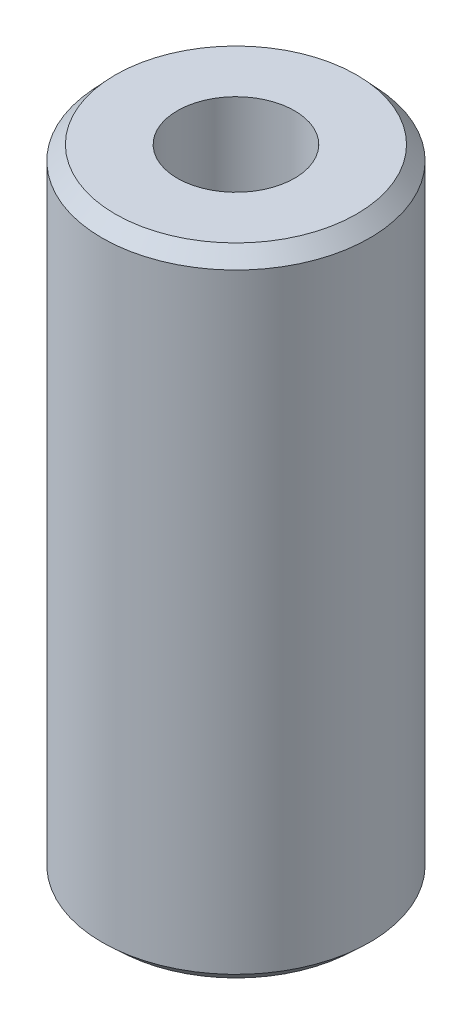
ISO-10303-21;
HEADER;
FILE_DESCRIPTION(('STEP AP214'),'2;1');
FILE_NAME('part.step','',(''),(''),'','','');
FILE_SCHEMA(('AUTOMOTIVE_DESIGN { 1 0 10303 214 1 1 1 1 }'));
ENDSEC;
DATA;
#1=APPLICATION_CONTEXT('core data for automotive mechanical design processes');
#2=APPLICATION_PROTOCOL_DEFINITION('international standard','automotive_design',2000,#1);
#3=PRODUCT_CONTEXT('',#1,'mechanical');
#4=PRODUCT('Part','Part','',(#3));
#5=PRODUCT_RELATED_PRODUCT_CATEGORY('part','',(#4));
#6=PRODUCT_DEFINITION_FORMATION('','',#4);
#7=PRODUCT_DEFINITION_CONTEXT('part definition',#1,'design');
#8=PRODUCT_DEFINITION('design','',#6,#7);
#9=PRODUCT_DEFINITION_SHAPE('','',#8);
#10=(LENGTH_UNIT() NAMED_UNIT(*) SI_UNIT(.MILLI.,.METRE.));
#11=(NAMED_UNIT(*) PLANE_ANGLE_UNIT() SI_UNIT($,.RADIAN.));
#12=(NAMED_UNIT(*) SI_UNIT($,.STERADIAN.) SOLID_ANGLE_UNIT());
#13=UNCERTAINTY_MEASURE_WITH_UNIT(LENGTH_MEASURE(1.E-05),#10,'distance_accuracy_value','');
#14=(GEOMETRIC_REPRESENTATION_CONTEXT(3) GLOBAL_UNCERTAINTY_ASSIGNED_CONTEXT((#13)) GLOBAL_UNIT_ASSIGNED_CONTEXT((#10,
#11,#12)) REPRESENTATION_CONTEXT('',''));
#15=CARTESIAN_POINT('',(0.,0.,0.));
#16=DIRECTION('',(0.,0.,1.));
#17=DIRECTION('',(1.,0.,0.));
#18=AXIS2_PLACEMENT_3D('',#15,#16,#17);
#19=CARTESIAN_POINT('',(0.,107.189800782786,0.));
#20=DIRECTION('',(0.,-1.,0.));
#21=DIRECTION('',(0.,0.,-1.));
#22=AXIS2_PLACEMENT_3D('',#19,#20,#21);
#23=CYLINDRICAL_SURFACE('',#22,22.5);
#24=CARTESIAN_POINT('',(0.,104.806707955269,0.));
#25=DIRECTION('',(0.,1.,0.));
#26=DIRECTION('',(0.,0.,1.));
#27=AXIS2_PLACEMENT_3D('',#24,#25,#26);
#28=CIRCLE('',#27,22.5);
#29=CARTESIAN_POINT('',(0.,104.806707955269,22.5));
#30=VERTEX_POINT('',#29);
#31=EDGE_CURVE('E50',#30,#30,#28,.F.);
#32=ORIENTED_EDGE('',*,*,#31,.T.);
#33=EDGE_LOOP('',(#32));
#34=FACE_BOUND('',#33,.T.);
#35=CARTESIAN_POINT('',(0.,2.2110738446755,0.));
#36=DIRECTION('',(0.,1.,0.));
#37=DIRECTION('',(0.,0.,1.));
#38=AXIS2_PLACEMENT_3D('',#35,#36,#37);
#39=CIRCLE('',#38,22.5);
#40=CARTESIAN_POINT('',(0.,2.2110738446755,22.5));
#41=VERTEX_POINT('',#40);
#42=EDGE_CURVE('E51',#41,#41,#39,.T.);
#43=ORIENTED_EDGE('',*,*,#42,.T.);
#44=EDGE_LOOP('',(#43));
#45=FACE_BOUND('',#44,.T.);
#46=ADVANCED_FACE('F39',(#34,#45),#23,.T.);
#47=CARTESIAN_POINT('',(0.,107.189800782786,0.));
#48=DIRECTION('',(0.,1.,0.));
#49=DIRECTION('',(0.,0.,1.));
#50=AXIS2_PLACEMENT_3D('',#47,#48,#49);
#51=PLANE('',#50);
#52=CARTESIAN_POINT('',(0.,107.189800782786,0.));
#53=DIRECTION('',(0.,1.,0.));
#54=DIRECTION('',(0.,0.,1.));
#55=AXIS2_PLACEMENT_3D('',#52,#53,#54);
#56=CIRCLE('',#55,20.2889261553245);
#57=CARTESIAN_POINT('',(0.,107.189800782786,20.2889261553245));
#58=VERTEX_POINT('',#57);
#59=EDGE_CURVE('E54',#58,#58,#56,.T.);
#60=ORIENTED_EDGE('',*,*,#59,.T.);
#61=EDGE_LOOP('',(#60));
#62=FACE_BOUND('',#61,.T.);
#63=CARTESIAN_POINT('',(0.,107.189800782786,0.));
#64=DIRECTION('',(0.,1.,0.));
#65=DIRECTION('',(0.,0.,1.));
#66=AXIS2_PLACEMENT_3D('',#63,#64,#65);
#67=CIRCLE('',#66,9.85415969341051);
#68=CARTESIAN_POINT('',(0.,107.189800782786,9.85415969341051));
#69=VERTEX_POINT('',#68);
#70=EDGE_CURVE('E58',#69,#69,#67,.T.);
#71=ORIENTED_EDGE('',*,*,#70,.F.);
#72=EDGE_LOOP('',(#71));
#73=FACE_BOUND('',#72,.T.);
#74=ADVANCED_FACE('F69',(#62,#73),#51,.T.);
#75=CARTESIAN_POINT('',(0.,0.,0.));
#76=DIRECTION('',(0.,1.,0.));
#77=DIRECTION('',(0.,0.,1.));
#78=AXIS2_PLACEMENT_3D('',#75,#76,#77);
#79=PLANE('',#78);
#80=CARTESIAN_POINT('',(0.,0.,0.));
#81=DIRECTION('',(0.,1.,0.));
#82=DIRECTION('',(0.,0.,1.));
#83=AXIS2_PLACEMENT_3D('',#80,#81,#82);
#84=CIRCLE('',#83,20.1169071724821);
#85=CARTESIAN_POINT('',(0.,0.,20.1169071724821));
#86=VERTEX_POINT('',#85);
#87=EDGE_CURVE('E10',#86,#86,#84,.F.);
#88=ORIENTED_EDGE('',*,*,#87,.T.);
#89=EDGE_LOOP('',(#88));
#90=FACE_BOUND('',#89,.T.);
#91=CARTESIAN_POINT('',(0.,0.,0.));
#92=DIRECTION('',(0.,1.,0.));
#93=DIRECTION('',(0.,0.,1.));
#94=AXIS2_PLACEMENT_3D('',#91,#92,#93);
#95=CIRCLE('',#94,9.85415969341051);
#96=CARTESIAN_POINT('',(0.,0.,9.85415969341051));
#97=VERTEX_POINT('',#96);
#98=EDGE_CURVE('E63',#97,#97,#95,.T.);
#99=ORIENTED_EDGE('',*,*,#98,.T.);
#100=EDGE_LOOP('',(#99));
#101=FACE_BOUND('',#100,.T.);
#102=ADVANCED_FACE('F75',(#90,#101),#79,.F.);
#103=CARTESIAN_POINT('',(0.,107.189800782786,0.));
#104=DIRECTION('',(0.,-1.,0.));
#105=DIRECTION('',(0.,0.,-1.));
#106=AXIS2_PLACEMENT_3D('',#103,#104,#105);
#107=CYLINDRICAL_SURFACE('',#106,9.85415969341051);
#108=ORIENTED_EDGE('',*,*,#70,.T.);
#109=EDGE_LOOP('',(#108));
#110=FACE_BOUND('',#109,.T.);
#111=ORIENTED_EDGE('',*,*,#98,.F.);
#112=EDGE_LOOP('',(#111));
#113=FACE_BOUND('',#112,.T.);
#114=ADVANCED_FACE('F70',(#110,#113),#107,.F.);
#115=CARTESIAN_POINT('',(0.,107.189800782786,0.));
#116=DIRECTION('',(0.,-1.,0.));
#117=DIRECTION('',(0.,0.,-1.));
#118=AXIS2_PLACEMENT_3D('',#115,#116,#117);
#119=CONICAL_SURFACE('',#118,20.2889261553245,0.747972733699123);
#120=ORIENTED_EDGE('',*,*,#31,.F.);
#121=EDGE_LOOP('',(#120));
#122=FACE_BOUND('',#121,.T.);
#123=ORIENTED_EDGE('',*,*,#59,.F.);
#124=EDGE_LOOP('',(#123));
#125=FACE_BOUND('',#124,.T.);
#126=ADVANCED_FACE('F81',(#122,#125),#119,.T.);
#127=CARTESIAN_POINT('',(0.,2.2110738446755,0.));
#128=DIRECTION('',(0.,1.,0.));
#129=DIRECTION('',(0.,0.,1.));
#130=AXIS2_PLACEMENT_3D('',#127,#128,#129);
#131=CONICAL_SURFACE('',#130,22.5,0.822823593095776);
#132=ORIENTED_EDGE('',*,*,#87,.F.);
#133=EDGE_LOOP('',(#132));
#134=FACE_BOUND('',#133,.T.);
#135=ORIENTED_EDGE('',*,*,#42,.F.);
#136=EDGE_LOOP('',(#135));
#137=FACE_BOUND('',#136,.T.);
#138=ADVANCED_FACE('F45',(#134,#137),#131,.T.);
#139=CLOSED_SHELL('',(#46,#74,#102,#114,#126,#138));
#140=MANIFOLD_SOLID_BREP('B2',#139);
#141=ADVANCED_BREP_SHAPE_REPRESENTATION('',(#18,#140),#14);
#142=SHAPE_DEFINITION_REPRESENTATION(#9,#141);
ENDSEC;
END-ISO-10303-21;
